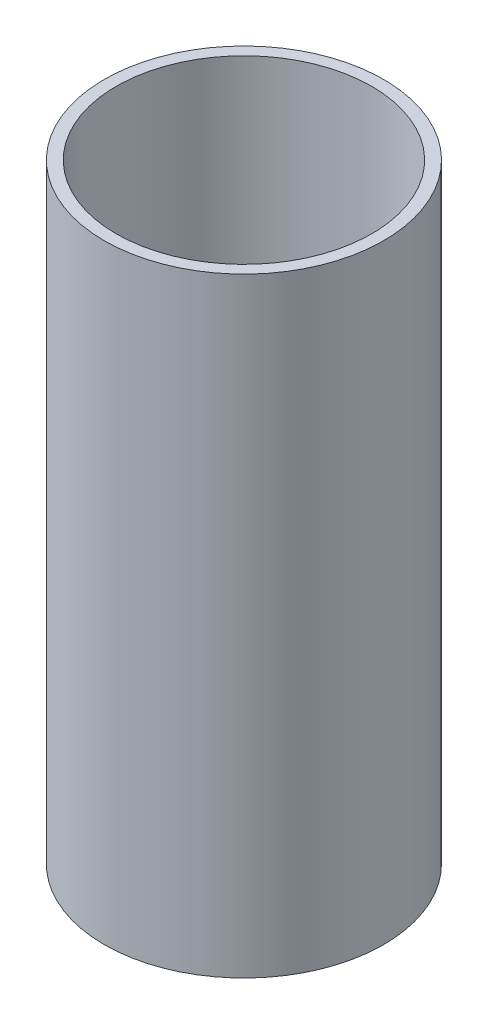
ISO-10303-21;
HEADER;
FILE_DESCRIPTION(('STEP AP214'),'2;1');
FILE_NAME('part.step','',(''),(''),'','','');
FILE_SCHEMA(('AUTOMOTIVE_DESIGN { 1 0 10303 214 1 1 1 1 }'));
ENDSEC;
DATA;
#1=APPLICATION_CONTEXT('core data for automotive mechanical design processes');
#2=APPLICATION_PROTOCOL_DEFINITION('international standard','automotive_design',2000,#1);
#3=PRODUCT_CONTEXT('',#1,'mechanical');
#4=PRODUCT('Part','Part','',(#3));
#5=PRODUCT_RELATED_PRODUCT_CATEGORY('part','',(#4));
#6=PRODUCT_DEFINITION_FORMATION('','',#4);
#7=PRODUCT_DEFINITION_CONTEXT('part definition',#1,'design');
#8=PRODUCT_DEFINITION('design','',#6,#7);
#9=PRODUCT_DEFINITION_SHAPE('','',#8);
#10=(LENGTH_UNIT() NAMED_UNIT(*) SI_UNIT(.MILLI.,.METRE.));
#11=(NAMED_UNIT(*) PLANE_ANGLE_UNIT() SI_UNIT($,.RADIAN.));
#12=(NAMED_UNIT(*) SI_UNIT($,.STERADIAN.) SOLID_ANGLE_UNIT());
#13=UNCERTAINTY_MEASURE_WITH_UNIT(LENGTH_MEASURE(1.E-05),#10,'distance_accuracy_value','');
#14=(GEOMETRIC_REPRESENTATION_CONTEXT(3) GLOBAL_UNCERTAINTY_ASSIGNED_CONTEXT((#13)) GLOBAL_UNIT_ASSIGNED_CONTEXT((#10,
#11,#12)) REPRESENTATION_CONTEXT('',''));
#15=CARTESIAN_POINT('',(0.,0.,0.));
#16=DIRECTION('',(0.,0.,1.));
#17=DIRECTION('',(1.,0.,0.));
#18=AXIS2_PLACEMENT_3D('',#15,#16,#17);
#19=CARTESIAN_POINT('',(0.,304.8,0.));
#20=DIRECTION('',(0.,1.,0.));
#21=DIRECTION('',(0.,0.,1.));
#22=AXIS2_PLACEMENT_3D('',#19,#20,#21);
#23=PLANE('',#22);
#24=CARTESIAN_POINT('',(0.,304.8,0.));
#25=DIRECTION('',(0.,1.,0.));
#26=DIRECTION('',(0.,0.,1.));
#27=AXIS2_PLACEMENT_3D('',#24,#25,#26);
#28=CIRCLE('',#27,69.85);
#29=CARTESIAN_POINT('',(0.,304.8,69.85));
#30=VERTEX_POINT('',#29);
#31=EDGE_CURVE('E10',#30,#30,#28,.T.);
#32=ORIENTED_EDGE('',*,*,#31,.T.);
#33=EDGE_LOOP('',(#32));
#34=FACE_BOUND('',#33,.T.);
#35=CARTESIAN_POINT('',(0.,304.8,0.));
#36=DIRECTION('',(0.,1.,0.));
#37=DIRECTION('',(0.,0.,1.));
#38=AXIS2_PLACEMENT_3D('',#35,#36,#37);
#39=CIRCLE('',#38,63.881);
#40=CARTESIAN_POINT('',(0.,304.8,63.881));
#41=VERTEX_POINT('',#40);
#42=EDGE_CURVE('E42',#41,#41,#39,.T.);
#43=ORIENTED_EDGE('',*,*,#42,.F.);
#44=EDGE_LOOP('',(#43));
#45=FACE_BOUND('',#44,.T.);
#46=ADVANCED_FACE('F31',(#34,#45),#23,.T.);
#47=CARTESIAN_POINT('',(0.,0.,0.));
#48=DIRECTION('',(0.,1.,0.));
#49=DIRECTION('',(0.,0.,1.));
#50=AXIS2_PLACEMENT_3D('',#47,#48,#49);
#51=PLANE('',#50);
#52=CARTESIAN_POINT('',(0.,0.,0.));
#53=DIRECTION('',(0.,1.,0.));
#54=DIRECTION('',(0.,0.,1.));
#55=AXIS2_PLACEMENT_3D('',#52,#53,#54);
#56=CIRCLE('',#55,69.85);
#57=CARTESIAN_POINT('',(0.,0.,69.85));
#58=VERTEX_POINT('',#57);
#59=EDGE_CURVE('E35',#58,#58,#56,.T.);
#60=ORIENTED_EDGE('',*,*,#59,.F.);
#61=EDGE_LOOP('',(#60));
#62=FACE_BOUND('',#61,.T.);
#63=CARTESIAN_POINT('',(0.,0.,0.));
#64=DIRECTION('',(0.,1.,0.));
#65=DIRECTION('',(0.,0.,1.));
#66=AXIS2_PLACEMENT_3D('',#63,#64,#65);
#67=CIRCLE('',#66,63.881);
#68=CARTESIAN_POINT('',(0.,0.,63.881));
#69=VERTEX_POINT('',#68);
#70=EDGE_CURVE('E44',#69,#69,#67,.T.);
#71=ORIENTED_EDGE('',*,*,#70,.T.);
#72=EDGE_LOOP('',(#71));
#73=FACE_BOUND('',#72,.T.);
#74=ADVANCED_FACE('F54',(#62,#73),#51,.F.);
#75=CARTESIAN_POINT('',(0.,304.8,0.));
#76=DIRECTION('',(0.,-1.,0.));
#77=DIRECTION('',(0.,0.,-1.));
#78=AXIS2_PLACEMENT_3D('',#75,#76,#77);
#79=CYLINDRICAL_SURFACE('',#78,69.85);
#80=ORIENTED_EDGE('',*,*,#31,.F.);
#81=EDGE_LOOP('',(#80));
#82=FACE_BOUND('',#81,.T.);
#83=ORIENTED_EDGE('',*,*,#59,.T.);
#84=EDGE_LOOP('',(#83));
#85=FACE_BOUND('',#84,.T.);
#86=ADVANCED_FACE('F33',(#82,#85),#79,.T.);
#87=CARTESIAN_POINT('',(0.,304.8,0.));
#88=DIRECTION('',(0.,-1.,0.));
#89=DIRECTION('',(0.,0.,-1.));
#90=AXIS2_PLACEMENT_3D('',#87,#88,#89);
#91=CYLINDRICAL_SURFACE('',#90,63.881);
#92=ORIENTED_EDGE('',*,*,#42,.T.);
#93=EDGE_LOOP('',(#92));
#94=FACE_BOUND('',#93,.T.);
#95=ORIENTED_EDGE('',*,*,#70,.F.);
#96=EDGE_LOOP('',(#95));
#97=FACE_BOUND('',#96,.T.);
#98=ADVANCED_FACE('F50',(#94,#97),#91,.F.);
#99=CLOSED_SHELL('',(#46,#74,#86,#98));
#100=MANIFOLD_SOLID_BREP('B2',#99);
#101=ADVANCED_BREP_SHAPE_REPRESENTATION('',(#18,#100),#14);
#102=SHAPE_DEFINITION_REPRESENTATION(#9,#101);
ENDSEC;
END-ISO-10303-21;
